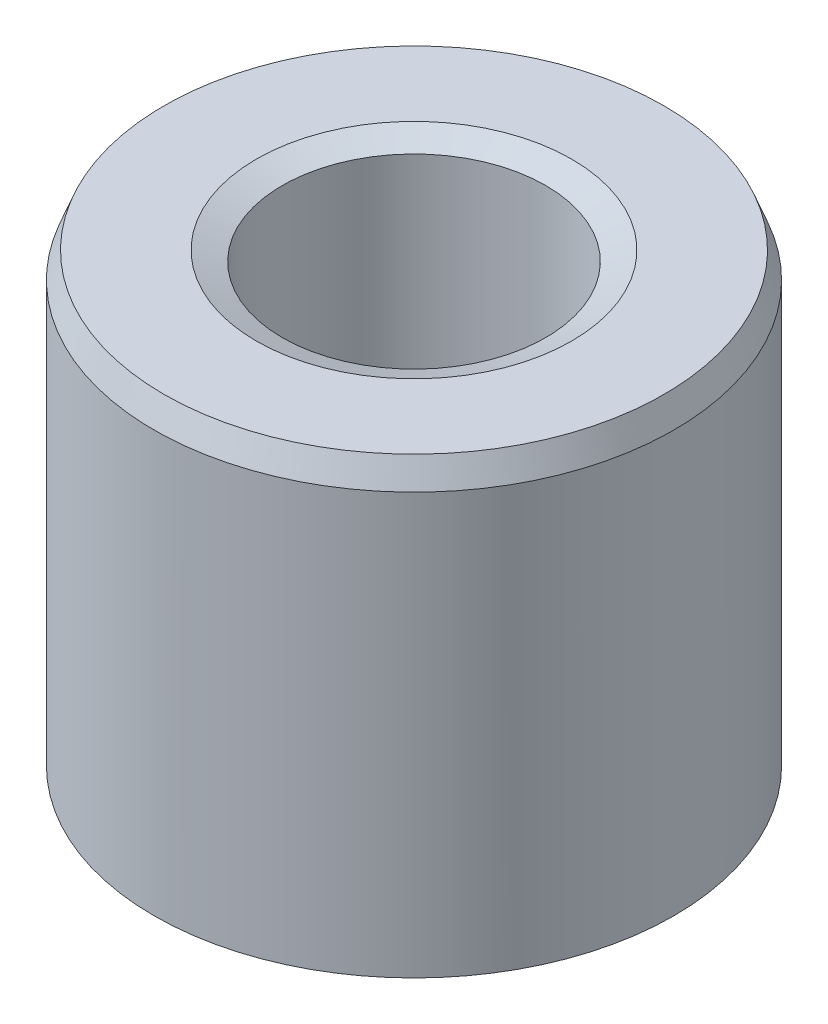
ISO-10303-21;
HEADER;
FILE_DESCRIPTION(('STEP AP214'),'2;1');
FILE_NAME('part.step','',(''),(''),'','','');
FILE_SCHEMA(('AUTOMOTIVE_DESIGN { 1 0 10303 214 1 1 1 1 }'));
ENDSEC;
DATA;
#1=APPLICATION_CONTEXT('core data for automotive mechanical design processes');
#2=APPLICATION_PROTOCOL_DEFINITION('international standard','automotive_design',2000,#1);
#3=PRODUCT_CONTEXT('',#1,'mechanical');
#4=PRODUCT('Part','Part','',(#3));
#5=PRODUCT_RELATED_PRODUCT_CATEGORY('part','',(#4));
#6=PRODUCT_DEFINITION_FORMATION('','',#4);
#7=PRODUCT_DEFINITION_CONTEXT('part definition',#1,'design');
#8=PRODUCT_DEFINITION('design','',#6,#7);
#9=PRODUCT_DEFINITION_SHAPE('','',#8);
#10=(LENGTH_UNIT() NAMED_UNIT(*) SI_UNIT(.MILLI.,.METRE.));
#11=(NAMED_UNIT(*) PLANE_ANGLE_UNIT() SI_UNIT($,.RADIAN.));
#12=(NAMED_UNIT(*) SI_UNIT($,.STERADIAN.) SOLID_ANGLE_UNIT());
#13=UNCERTAINTY_MEASURE_WITH_UNIT(LENGTH_MEASURE(1.E-05),#10,'distance_accuracy_value','');
#14=(GEOMETRIC_REPRESENTATION_CONTEXT(3) GLOBAL_UNCERTAINTY_ASSIGNED_CONTEXT((#13)) GLOBAL_UNIT_ASSIGNED_CONTEXT((#10,
#11,#12)) REPRESENTATION_CONTEXT('',''));
#15=CARTESIAN_POINT('',(0.,0.,0.));
#16=DIRECTION('',(0.,0.,1.));
#17=DIRECTION('',(1.,0.,0.));
#18=AXIS2_PLACEMENT_3D('',#15,#16,#17);
#19=CARTESIAN_POINT('',(0.,52.6918310526499,0.));
#20=DIRECTION('',(0.,-1.,0.));
#21=DIRECTION('',(0.,0.,-1.));
#22=AXIS2_PLACEMENT_3D('',#19,#20,#21);
#23=CYLINDRICAL_SURFACE('',#22,30.);
#24=CARTESIAN_POINT('',(0.,1.14667513449022,0.));
#25=DIRECTION('',(0.,1.,0.));
#26=DIRECTION('',(0.,0.,1.));
#27=AXIS2_PLACEMENT_3D('',#24,#25,#26);
#28=CIRCLE('',#27,30.);
#29=CARTESIAN_POINT('',(0.,1.14667513449022,-30.));
#30=VERTEX_POINT('',#29);
#31=EDGE_CURVE('E10',#30,#30,#28,.T.);
#32=CARTESIAN_POINT('',(0.,49.7048563511149,0.));
#33=DIRECTION('',(0.,1.,0.));
#34=DIRECTION('',(0.,0.,1.));
#35=AXIS2_PLACEMENT_3D('',#32,#33,#34);
#36=CIRCLE('',#35,30.);
#37=CARTESIAN_POINT('',(0.,49.7048563511149,-30.));
#38=VERTEX_POINT('',#37);
#39=EDGE_CURVE('E50',#38,#38,#36,.F.);
#40=CARTESIAN_POINT('',(0.,1.14667513449022,-30.));
#41=CARTESIAN_POINT('',(0.,1.65248952216339,-30.));
#42=CARTESIAN_POINT('',(0.,2.15830390983657,-30.));
#43=CARTESIAN_POINT('',(0.,3.16993268518291,-30.));
#44=CARTESIAN_POINT('',(0.,3.67574707285609,-30.));
#45=CARTESIAN_POINT('',(0.,4.68737584820243,-30.));
#46=CARTESIAN_POINT('',(0.,5.19319023587561,-30.));
#47=CARTESIAN_POINT('',(0.,6.20481901122196,-30.));
#48=CARTESIAN_POINT('',(0.,6.71063339889513,-30.));
#49=CARTESIAN_POINT('',(0.,7.72226217424148,-30.));
#50=CARTESIAN_POINT('',(0.,8.22807656191465,-30.));
#51=CARTESIAN_POINT('',(0.,9.239705337261,-30.));
#52=CARTESIAN_POINT('',(0.,9.74551972493417,-30.));
#53=CARTESIAN_POINT('',(0.,10.7571485002805,-30.));
#54=CARTESIAN_POINT('',(0.,11.2629628879537,-30.));
#55=CARTESIAN_POINT('',(0.,12.2745916633,-30.));
#56=CARTESIAN_POINT('',(0.,12.7804060509732,-30.));
#57=CARTESIAN_POINT('',(0.,13.7920348263196,-30.));
#58=CARTESIAN_POINT('',(0.,14.2978492139927,-30.));
#59=CARTESIAN_POINT('',(0.,15.3094779893391,-30.));
#60=CARTESIAN_POINT('',(0.,15.8152923770123,-30.));
#61=CARTESIAN_POINT('',(0.,16.8269211523586,-30.));
#62=CARTESIAN_POINT('',(0.,17.3327355400318,-30.));
#63=CARTESIAN_POINT('',(0.,18.3443643153781,-30.));
#64=CARTESIAN_POINT('',(0.,18.8501787030513,-30.));
#65=CARTESIAN_POINT('',(0.,19.8618074783976,-30.));
#66=CARTESIAN_POINT('',(0.,20.3676218660708,-30.));
#67=CARTESIAN_POINT('',(0.,21.3792506414172,-30.));
#68=CARTESIAN_POINT('',(0.,21.8850650290903,-30.));
#69=CARTESIAN_POINT('',(0.,22.8966938044367,-30.));
#70=CARTESIAN_POINT('',(0.,23.4025081921099,-30.));
#71=CARTESIAN_POINT('',(0.,24.4141369674562,-30.));
#72=CARTESIAN_POINT('',(0.,24.9199513551294,-30.));
#73=CARTESIAN_POINT('',(0.,25.9315801304757,-30.));
#74=CARTESIAN_POINT('',(0.,26.4373945181489,-30.));
#75=CARTESIAN_POINT('',(0.,27.4490232934953,-30.));
#76=CARTESIAN_POINT('',(0.,27.9548376811684,-30.));
#77=CARTESIAN_POINT('',(0.,28.9664664565148,-30.));
#78=CARTESIAN_POINT('',(0.,29.4722808441879,-30.));
#79=CARTESIAN_POINT('',(0.,30.4839096195343,-30.));
#80=CARTESIAN_POINT('',(0.,30.9897240072075,-30.));
#81=CARTESIAN_POINT('',(0.,32.0013527825538,-30.));
#82=CARTESIAN_POINT('',(0.,32.507167170227,-30.));
#83=CARTESIAN_POINT('',(0.,33.5187959455733,-30.));
#84=CARTESIAN_POINT('',(0.,34.0246103332465,-30.));
#85=CARTESIAN_POINT('',(0.,35.0362391085929,-30.));
#86=CARTESIAN_POINT('',(0.,35.542053496266,-30.));
#87=CARTESIAN_POINT('',(0.,36.5536822716124,-30.));
#88=CARTESIAN_POINT('',(0.,37.0594966592855,-30.));
#89=CARTESIAN_POINT('',(0.,38.0711254346319,-30.));
#90=CARTESIAN_POINT('',(0.,38.5769398223051,-30.));
#91=CARTESIAN_POINT('',(0.,39.5885685976514,-30.));
#92=CARTESIAN_POINT('',(0.,40.0943829853246,-30.));
#93=CARTESIAN_POINT('',(0.,41.1060117606709,-30.));
#94=CARTESIAN_POINT('',(0.,41.6118261483441,-30.));
#95=CARTESIAN_POINT('',(0.,42.6234549236905,-30.));
#96=CARTESIAN_POINT('',(0.,43.1292693113636,-30.));
#97=CARTESIAN_POINT('',(0.,44.14089808671,-30.));
#98=CARTESIAN_POINT('',(0.,44.6467124743832,-30.));
#99=CARTESIAN_POINT('',(0.,45.6583412497295,-30.));
#100=CARTESIAN_POINT('',(0.,46.1641556374027,-30.));
#101=CARTESIAN_POINT('',(0.,47.175784412749,-30.));
#102=CARTESIAN_POINT('',(0.,47.6815988004222,-30.));
#103=CARTESIAN_POINT('',(0.,48.6932275757685,-30.));
#104=CARTESIAN_POINT('',(0.,49.1990419634417,-30.));
#105=CARTESIAN_POINT('',(0.,49.7048563511149,-30.));
#106=B_SPLINE_CURVE_WITH_KNOTS('',3,(#40,#41,#42,#43,#44,#45,#46,#47,#48,#49,#50,#51,#52,#53,
#54,#55,#56,#57,#58,#59,#60,#61,#62,#63,#64,#65,#66,#67,#68,#69,#70,#71,#72,#73,#74,#75,#76,#77,
#78,#79,#80,#81,#82,#83,#84,#85,#86,#87,#88,#89,#90,#91,#92,#93,#94,#95,#96,#97,#98,#99,#100,
#101,#102,#103,#104,#105),.UNSPECIFIED.,.F.,.F.,(4,2,2,2,2,2,2,2,2,2,2,2,2,2,2,2,2,2,2,2,2,2,2,
2,2,2,2,2,2,2,2,2,4),(0.,1.51744316301952,3.03488632603904,4.55232948905857,6.06977265207809,
7.58721581509761,9.10465897811713,10.6221021411367,12.1395453041562,13.6569884671757,
15.1744316301952,16.6918747932147,18.2093179562343,19.7267611192538,21.2442042822733,
22.7616474452928,24.2790906083123,25.7965337713319,27.3139769343514,28.8314200973709,
30.3488632603904,31.8663064234099,33.3837495864295,34.901192749449,36.4186359124685,
37.936079075488,39.4535222385075,40.9709654015271,42.4884085645466,44.0058517275661,
45.5232948905856,47.0407380536052,48.5581812166247),.UNSPECIFIED.);
#107=EDGE_CURVE('BSEAM39',#30,#38,#106,.T.);
#108=ORIENTED_EDGE('',*,*,#31,.T.);
#109=ORIENTED_EDGE('',*,*,#39,.T.);
#110=ORIENTED_EDGE('',*,*,#107,.T.);
#111=ORIENTED_EDGE('',*,*,#107,.F.);
#112=EDGE_LOOP('',(#108,#110,#109,#111));
#113=FACE_BOUND('',#112,.T.);
#114=ADVANCED_FACE('F39',(#113),#23,.T.);
#115=CARTESIAN_POINT('',(0.,52.6918310526499,0.));
#116=DIRECTION('',(0.,1.,0.));
#117=DIRECTION('',(0.,0.,1.));
#118=AXIS2_PLACEMENT_3D('',#115,#116,#117);
#119=PLANE('',#118);
#120=CARTESIAN_POINT('',(0.,52.6918310526499,0.));
#121=DIRECTION('',(0.,1.,0.));
#122=DIRECTION('',(0.,0.,1.));
#123=AXIS2_PLACEMENT_3D('',#120,#121,#122);
#124=CIRCLE('',#123,18.1944961918167);
#125=CARTESIAN_POINT('',(0.,52.6918310526499,18.1944961918167));
#126=VERTEX_POINT('',#125);
#127=EDGE_CURVE('E58',#126,#126,#124,.F.);
#128=ORIENTED_EDGE('',*,*,#127,.T.);
#129=EDGE_LOOP('',(#128));
#130=FACE_BOUND('',#129,.T.);
#131=CARTESIAN_POINT('',(0.,52.6918310526499,0.));
#132=DIRECTION('',(0.,1.,0.));
#133=DIRECTION('',(0.,0.,1.));
#134=AXIS2_PLACEMENT_3D('',#131,#132,#133);
#135=CIRCLE('',#134,28.8533248655099);
#136=CARTESIAN_POINT('',(0.,52.6918310526499,28.8533248655099));
#137=VERTEX_POINT('',#136);
#138=EDGE_CURVE('E61',#137,#137,#135,.T.);
#139=ORIENTED_EDGE('',*,*,#138,.T.);
#140=EDGE_LOOP('',(#139));
#141=FACE_BOUND('',#140,.T.);
#142=ADVANCED_FACE('F88',(#130,#141),#119,.T.);
#143=CARTESIAN_POINT('',(0.,0.,0.));
#144=DIRECTION('',(0.,1.,0.));
#145=DIRECTION('',(0.,0.,1.));
#146=AXIS2_PLACEMENT_3D('',#143,#144,#145);
#147=PLANE('',#146);
#148=CARTESIAN_POINT('',(0.,0.,0.));
#149=DIRECTION('',(0.,1.,0.));
#150=DIRECTION('',(0.,0.,1.));
#151=AXIS2_PLACEMENT_3D('',#148,#149,#150);
#152=CIRCLE('',#151,16.3541966247715);
#153=CARTESIAN_POINT('',(0.,0.,16.3541966247715));
#154=VERTEX_POINT('',#153);
#155=EDGE_CURVE('E51',#154,#154,#152,.T.);
#156=ORIENTED_EDGE('',*,*,#155,.T.);
#157=EDGE_LOOP('',(#156));
#158=FACE_BOUND('',#157,.T.);
#159=CARTESIAN_POINT('',(0.,0.,0.));
#160=DIRECTION('',(0.,1.,0.));
#161=DIRECTION('',(0.,0.,1.));
#162=AXIS2_PLACEMENT_3D('',#159,#160,#161);
#163=CIRCLE('',#162,27.0130252984646);
#164=CARTESIAN_POINT('',(0.,0.,27.0130252984646));
#165=VERTEX_POINT('',#164);
#166=EDGE_CURVE('E54',#165,#165,#163,.F.);
#167=ORIENTED_EDGE('',*,*,#166,.T.);
#168=EDGE_LOOP('',(#167));
#169=FACE_BOUND('',#168,.T.);
#170=ADVANCED_FACE('F83',(#158,#169),#147,.F.);
#171=CARTESIAN_POINT('',(0.,52.6918310526499,0.));
#172=DIRECTION('',(0.,-1.,0.));
#173=DIRECTION('',(0.,0.,-1.));
#174=AXIS2_PLACEMENT_3D('',#171,#172,#173);
#175=CYLINDRICAL_SURFACE('',#174,15.2075214902813);
#176=CARTESIAN_POINT('',(0.,51.5451559181597,0.));
#177=DIRECTION('',(0.,1.,0.));
#178=DIRECTION('',(0.,0.,1.));
#179=AXIS2_PLACEMENT_3D('',#176,#177,#178);
#180=CIRCLE('',#179,15.2075214902813);
#181=CARTESIAN_POINT('',(0.,51.5451559181597,-15.2075214902813));
#182=VERTEX_POINT('',#181);
#183=EDGE_CURVE('E67',#182,#182,#180,.T.);
#184=CARTESIAN_POINT('',(0.,2.98697470153522,0.));
#185=DIRECTION('',(0.,1.,0.));
#186=DIRECTION('',(0.,0.,1.));
#187=AXIS2_PLACEMENT_3D('',#184,#185,#186);
#188=CIRCLE('',#187,15.2075214902813);
#189=CARTESIAN_POINT('',(0.,2.98697470153522,-15.2075214902813));
#190=VERTEX_POINT('',#189);
#191=EDGE_CURVE('E69',#190,#190,#188,.F.);
#192=CARTESIAN_POINT('',(0.,51.5451559181597,-15.2075214902813));
#193=CARTESIAN_POINT('',(0.,51.0393415304865,-15.2075214902813));
#194=CARTESIAN_POINT('',(0.,50.5335271428134,-15.2075214902813));
#195=CARTESIAN_POINT('',(0.,49.521898367467,-15.2075214902813));
#196=CARTESIAN_POINT('',(0.,49.0160839797939,-15.2075214902813));
#197=CARTESIAN_POINT('',(0.,48.0044552044475,-15.2075214902813));
#198=CARTESIAN_POINT('',(0.,47.4986408167743,-15.2075214902813));
#199=CARTESIAN_POINT('',(0.,46.487012041428,-15.2075214902813));
#200=CARTESIAN_POINT('',(0.,45.9811976537548,-15.2075214902813));
#201=CARTESIAN_POINT('',(0.,44.9695688784085,-15.2075214902813));
#202=CARTESIAN_POINT('',(0.,44.4637544907353,-15.2075214902813));
#203=CARTESIAN_POINT('',(0.,43.452125715389,-15.2075214902813));
#204=CARTESIAN_POINT('',(0.,42.9463113277158,-15.2075214902813));
#205=CARTESIAN_POINT('',(0.,41.9346825523695,-15.2075214902813));
#206=CARTESIAN_POINT('',(0.,41.4288681646963,-15.2075214902813));
#207=CARTESIAN_POINT('',(0.,40.4172393893499,-15.2075214902813));
#208=CARTESIAN_POINT('',(0.,39.9114250016768,-15.2075214902813));
#209=CARTESIAN_POINT('',(0.,38.8997962263304,-15.2075214902813));
#210=CARTESIAN_POINT('',(0.,38.3939818386572,-15.2075214902813));
#211=CARTESIAN_POINT('',(0.,37.3823530633109,-15.2075214902813));
#212=CARTESIAN_POINT('',(0.,36.8765386756377,-15.2075214902813));
#213=CARTESIAN_POINT('',(0.,35.8649099002914,-15.2075214902813));
#214=CARTESIAN_POINT('',(0.,35.3590955126182,-15.2075214902813));
#215=CARTESIAN_POINT('',(0.,34.3474667372719,-15.2075214902813));
#216=CARTESIAN_POINT('',(0.,33.8416523495987,-15.2075214902813));
#217=CARTESIAN_POINT('',(0.,32.8300235742524,-15.2075214902813));
#218=CARTESIAN_POINT('',(0.,32.3242091865792,-15.2075214902813));
#219=CARTESIAN_POINT('',(0.,31.3125804112328,-15.2075214902813));
#220=CARTESIAN_POINT('',(0.,30.8067660235597,-15.2075214902813));
#221=CARTESIAN_POINT('',(0.,29.7951372482133,-15.2075214902813));
#222=CARTESIAN_POINT('',(0.,29.2893228605402,-15.2075214902813));
#223=CARTESIAN_POINT('',(0.,28.2776940851938,-15.2075214902813));
#224=CARTESIAN_POINT('',(0.,27.7718796975206,-15.2075214902813));
#225=CARTESIAN_POINT('',(0.,26.7602509221743,-15.2075214902813));
#226=CARTESIAN_POINT('',(0.,26.2544365345011,-15.2075214902813));
#227=CARTESIAN_POINT('',(0.,25.2428077591548,-15.2075214902813));
#228=CARTESIAN_POINT('',(0.,24.7369933714816,-15.2075214902813));
#229=CARTESIAN_POINT('',(0.,23.7253645961353,-15.2075214902813));
#230=CARTESIAN_POINT('',(0.,23.2195502084621,-15.2075214902813));
#231=CARTESIAN_POINT('',(0.,22.2079214331157,-15.2075214902813));
#232=CARTESIAN_POINT('',(0.,21.7021070454426,-15.2075214902813));
#233=CARTESIAN_POINT('',(0.,20.6904782700962,-15.2075214902813));
#234=CARTESIAN_POINT('',(0.,20.1846638824231,-15.2075214902813));
#235=CARTESIAN_POINT('',(0.,19.1730351070767,-15.2075214902813));
#236=CARTESIAN_POINT('',(0.,18.6672207194035,-15.2075214902813));
#237=CARTESIAN_POINT('',(0.,17.6555919440572,-15.2075214902813));
#238=CARTESIAN_POINT('',(0.,17.149777556384,-15.2075214902813));
#239=CARTESIAN_POINT('',(0.,16.1381487810377,-15.2075214902813));
#240=CARTESIAN_POINT('',(0.,15.6323343933645,-15.2075214902813));
#241=CARTESIAN_POINT('',(0.,14.6207056180182,-15.2075214902813));
#242=CARTESIAN_POINT('',(0.,14.114891230345,-15.2075214902813));
#243=CARTESIAN_POINT('',(0.,13.1032624549987,-15.2075214902813));
#244=CARTESIAN_POINT('',(0.,12.5974480673255,-15.2075214902813));
#245=CARTESIAN_POINT('',(0.,11.5858192919791,-15.2075214902813));
#246=CARTESIAN_POINT('',(0.,11.080004904306,-15.2075214902813));
#247=CARTESIAN_POINT('',(0.,10.0683761289596,-15.2075214902813));
#248=CARTESIAN_POINT('',(0.,9.56256174128645,-15.2075214902813));
#249=CARTESIAN_POINT('',(0.,8.5509329659401,-15.2075214902813));
#250=CARTESIAN_POINT('',(0.,8.04511857826694,-15.2075214902813));
#251=CARTESIAN_POINT('',(0.,7.03348980292059,-15.2075214902813));
#252=CARTESIAN_POINT('',(0.,6.52767541524742,-15.2075214902813));
#253=CARTESIAN_POINT('',(0.,5.51604663990108,-15.2075214902813));
#254=CARTESIAN_POINT('',(0.,5.01023225222791,-15.2075214902813));
#255=CARTESIAN_POINT('',(0.,3.99860347688156,-15.2075214902813));
#256=CARTESIAN_POINT('',(0.,3.49278908920839,-15.2075214902813));
#257=CARTESIAN_POINT('',(0.,2.98697470153522,-15.2075214902813));
#258=B_SPLINE_CURVE_WITH_KNOTS('',3,(#192,#193,#194,#195,#196,#197,#198,#199,#200,#201,#202,
#203,#204,#205,#206,#207,#208,#209,#210,#211,#212,#213,#214,#215,#216,#217,#218,#219,#220,#221,
#222,#223,#224,#225,#226,#227,#228,#229,#230,#231,#232,#233,#234,#235,#236,#237,#238,#239,#240,
#241,#242,#243,#244,#245,#246,#247,#248,#249,#250,#251,#252,#253,#254,#255,#256,#257),
.UNSPECIFIED.,.F.,.F.,(4,2,2,2,2,2,2,2,2,2,2,2,2,2,2,2,2,2,2,2,2,2,2,2,2,2,2,2,2,2,2,2,4),(0.,
1.51744316301952,3.03488632603904,4.55232948905855,6.06977265207807,7.58721581509758,
9.1046589781171,10.6221021411366,12.1395453041561,13.6569884671756,15.1744316301952,
16.6918747932147,18.2093179562342,19.7267611192537,21.2442042822732,22.7616474452927,
24.2790906083123,25.7965337713318,27.3139769343513,28.8314200973708,30.3488632603903,
31.8663064234098,33.3837495864293,34.9011927494489,36.4186359124684,37.9360790754879,
39.4535222385074,40.9709654015269,42.4884085645464,44.005851727566,45.5232948905855,
47.040738053605,48.5581812166245),.UNSPECIFIED.);
#259=EDGE_CURVE('BSEAM71',#182,#190,#258,.T.);
#260=ORIENTED_EDGE('',*,*,#183,.T.);
#261=ORIENTED_EDGE('',*,*,#191,.T.);
#262=ORIENTED_EDGE('',*,*,#259,.T.);
#263=ORIENTED_EDGE('',*,*,#259,.F.);
#264=EDGE_LOOP('',(#260,#262,#261,#263));
#265=FACE_BOUND('',#264,.T.);
#266=ADVANCED_FACE('F71',(#265),#175,.F.);
#267=CARTESIAN_POINT('',(0.,51.5451559181597,0.));
#268=DIRECTION('',(0.,1.,0.));
#269=DIRECTION('',(0.,0.,1.));
#270=AXIS2_PLACEMENT_3D('',#267,#268,#269);
#271=CONICAL_SURFACE('',#270,15.2075214902813,1.20425297332134);
#272=ORIENTED_EDGE('',*,*,#127,.F.);
#273=EDGE_LOOP('',(#272));
#274=FACE_BOUND('',#273,.T.);
#275=ORIENTED_EDGE('',*,*,#183,.F.);
#276=EDGE_LOOP('',(#275));
#277=FACE_BOUND('',#276,.T.);
#278=ADVANCED_FACE('F77',(#274,#277),#271,.F.);
#279=CARTESIAN_POINT('',(0.,0.,0.));
#280=DIRECTION('',(0.,-1.,0.));
#281=DIRECTION('',(0.,0.,-1.));
#282=AXIS2_PLACEMENT_3D('',#279,#280,#281);
#283=CONICAL_SURFACE('',#282,16.3541966247715,0.366543353473558);
#284=ORIENTED_EDGE('',*,*,#191,.F.);
#285=EDGE_LOOP('',(#284));
#286=FACE_BOUND('',#285,.T.);
#287=ORIENTED_EDGE('',*,*,#155,.F.);
#288=EDGE_LOOP('',(#287));
#289=FACE_BOUND('',#288,.T.);
#290=ADVANCED_FACE('F73',(#286,#289),#283,.F.);
#291=CARTESIAN_POINT('',(0.,1.14667513449022,0.));
#292=DIRECTION('',(0.,1.,0.));
#293=DIRECTION('',(0.,0.,1.));
#294=AXIS2_PLACEMENT_3D('',#291,#292,#293);
#295=CONICAL_SURFACE('',#294,30.,1.20425297332134);
#296=ORIENTED_EDGE('',*,*,#166,.F.);
#297=EDGE_LOOP('',(#296));
#298=FACE_BOUND('',#297,.T.);
#299=ORIENTED_EDGE('',*,*,#31,.F.);
#300=EDGE_LOOP('',(#299));
#301=FACE_BOUND('',#300,.T.);
#302=ADVANCED_FACE('F76',(#298,#301),#295,.T.);
#303=CARTESIAN_POINT('',(0.,52.6918310526499,0.));
#304=DIRECTION('',(0.,-1.,0.));
#305=DIRECTION('',(0.,0.,-1.));
#306=AXIS2_PLACEMENT_3D('',#303,#304,#305);
#307=CONICAL_SURFACE('',#306,28.8533248655099,0.366543353473562);
#308=ORIENTED_EDGE('',*,*,#39,.F.);
#309=EDGE_LOOP('',(#308));
#310=FACE_BOUND('',#309,.T.);
#311=ORIENTED_EDGE('',*,*,#138,.F.);
#312=EDGE_LOOP('',(#311));
#313=FACE_BOUND('',#312,.T.);
#314=ADVANCED_FACE('F45',(#310,#313),#307,.T.);
#315=CLOSED_SHELL('',(#114,#142,#170,#266,#278,#290,#302,#314));
#316=MANIFOLD_SOLID_BREP('B2',#315);
#317=ADVANCED_BREP_SHAPE_REPRESENTATION('',(#18,#316),#14);
#318=SHAPE_DEFINITION_REPRESENTATION(#9,#317);
ENDSEC;
END-ISO-10303-21;
